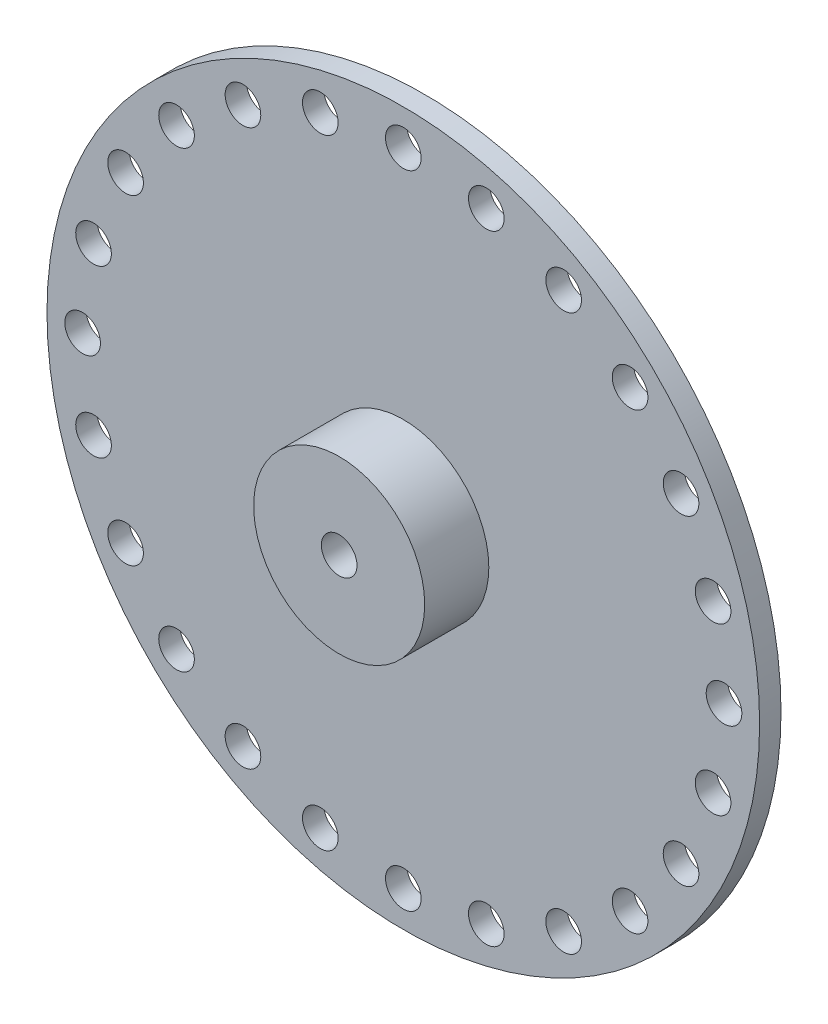
ISO-10303-21;
HEADER;
FILE_DESCRIPTION(('STEP AP214'),'2;1');
FILE_NAME('part.step','',(''),(''),'','','');
FILE_SCHEMA(('AUTOMOTIVE_DESIGN { 1 0 10303 214 1 1 1 1 }'));
ENDSEC;
DATA;
#1=APPLICATION_CONTEXT('core data for automotive mechanical design processes');
#2=APPLICATION_PROTOCOL_DEFINITION('international standard','automotive_design',2000,#1);
#3=PRODUCT_CONTEXT('',#1,'mechanical');
#4=PRODUCT('Part','Part','',(#3));
#5=PRODUCT_RELATED_PRODUCT_CATEGORY('part','',(#4));
#6=PRODUCT_DEFINITION_FORMATION('','',#4);
#7=PRODUCT_DEFINITION_CONTEXT('part definition',#1,'design');
#8=PRODUCT_DEFINITION('design','',#6,#7);
#9=PRODUCT_DEFINITION_SHAPE('','',#8);
#10=(LENGTH_UNIT() NAMED_UNIT(*) SI_UNIT(.MILLI.,.METRE.));
#11=(NAMED_UNIT(*) PLANE_ANGLE_UNIT() SI_UNIT($,.RADIAN.));
#12=(NAMED_UNIT(*) SI_UNIT($,.STERADIAN.) SOLID_ANGLE_UNIT());
#13=UNCERTAINTY_MEASURE_WITH_UNIT(LENGTH_MEASURE(1.E-05),#10,'distance_accuracy_value','');
#14=(GEOMETRIC_REPRESENTATION_CONTEXT(3) GLOBAL_UNCERTAINTY_ASSIGNED_CONTEXT((#13)) GLOBAL_UNIT_ASSIGNED_CONTEXT((#10,
#11,#12)) REPRESENTATION_CONTEXT('',''));
#15=CARTESIAN_POINT('',(0.,0.,0.));
#16=DIRECTION('',(0.,0.,1.));
#17=DIRECTION('',(1.,0.,0.));
#18=AXIS2_PLACEMENT_3D('',#15,#16,#17);
#19=CARTESIAN_POINT('',(0.,0.,1.5));
#20=DIRECTION('',(0.,0.,-1.));
#21=DIRECTION('',(-1.,0.,0.));
#22=AXIS2_PLACEMENT_3D('',#19,#20,#21);
#23=CYLINDRICAL_SURFACE('',#22,25.);
#24=CARTESIAN_POINT('',(0.,0.,1.5));
#25=DIRECTION('',(0.,0.,1.));
#26=DIRECTION('',(1.,0.,0.));
#27=AXIS2_PLACEMENT_3D('',#24,#25,#26);
#28=CIRCLE('',#27,25.);
#29=CARTESIAN_POINT('',(25.,0.,1.5));
#30=VERTEX_POINT('',#29);
#31=EDGE_CURVE('E52',#30,#30,#28,.T.);
#32=ORIENTED_EDGE('',*,*,#31,.F.);
#33=EDGE_LOOP('',(#32));
#34=FACE_BOUND('',#33,.T.);
#35=CARTESIAN_POINT('',(0.,0.,0.));
#36=DIRECTION('',(0.,0.,1.));
#37=DIRECTION('',(1.,0.,0.));
#38=AXIS2_PLACEMENT_3D('',#35,#36,#37);
#39=CIRCLE('',#38,25.);
#40=CARTESIAN_POINT('',(25.,0.,0.));
#41=VERTEX_POINT('',#40);
#42=EDGE_CURVE('E48',#41,#41,#39,.T.);
#43=ORIENTED_EDGE('',*,*,#42,.T.);
#44=EDGE_LOOP('',(#43));
#45=FACE_BOUND('',#44,.T.);
#46=ADVANCED_FACE('F45',(#34,#45),#23,.T.);
#47=CARTESIAN_POINT('',(0.,0.,1.5));
#48=DIRECTION('',(0.,0.,1.));
#49=DIRECTION('',(1.,0.,0.));
#50=AXIS2_PLACEMENT_3D('',#47,#48,#49);
#51=PLANE('',#50);
#52=CARTESIAN_POINT('',(-21.7333310915041,-5.8234285148065,1.5));
#53=DIRECTION('',(0.,0.,-1.));
#54=DIRECTION('',(0.258819045102511,-0.965925826289071,0.));
#55=AXIS2_PLACEMENT_3D('',#52,#53,#54);
#56=CIRCLE('',#55,1.25);
#57=CARTESIAN_POINT('',(-21.409807285126,-7.03083579766784,1.5));
#58=VERTEX_POINT('',#57);
#59=EDGE_CURVE('E131',#58,#58,#56,.T.);
#60=ORIENTED_EDGE('',*,*,#59,.T.);
#61=EDGE_LOOP('',(#60));
#62=FACE_BOUND('',#61,.T.);
#63=CARTESIAN_POINT('',(-19.48557158515,-11.2499999999998,1.5));
#64=DIRECTION('',(0.,0.,-1.));
#65=DIRECTION('',(0.499999999999992,-0.866025403784443,0.));
#66=AXIS2_PLACEMENT_3D('',#63,#64,#65);
#67=CIRCLE('',#66,1.25);
#68=CARTESIAN_POINT('',(-18.86057158515,-12.3325317547304,1.5));
#69=VERTEX_POINT('',#68);
#70=EDGE_CURVE('E138',#69,#69,#67,.T.);
#71=ORIENTED_EDGE('',*,*,#70,.T.);
#72=EDGE_LOOP('',(#71));
#73=FACE_BOUND('',#72,.T.);
#74=CARTESIAN_POINT('',(-15.9099025766975,-15.9099025766972,1.5));
#75=DIRECTION('',(0.,0.,-1.));
#76=DIRECTION('',(0.707106781186541,-0.707106781186554,0.));
#77=AXIS2_PLACEMENT_3D('',#74,#75,#76);
#78=CIRCLE('',#77,1.25);
#79=CARTESIAN_POINT('',(-15.0260191002143,-16.7937860531804,1.5));
#80=VERTEX_POINT('',#79);
#81=EDGE_CURVE('E144',#80,#80,#78,.T.);
#82=ORIENTED_EDGE('',*,*,#81,.T.);
#83=EDGE_LOOP('',(#82));
#84=FACE_BOUND('',#83,.T.);
#85=CARTESIAN_POINT('',(-11.2500000000002,-19.4855715851498,1.5));
#86=DIRECTION('',(0.,0.,-1.));
#87=DIRECTION('',(0.866025403784435,-0.500000000000007,0.));
#88=AXIS2_PLACEMENT_3D('',#85,#86,#87);
#89=CIRCLE('',#88,1.25);
#90=CARTESIAN_POINT('',(-10.1674682452696,-20.1105715851498,1.5));
#91=VERTEX_POINT('',#90);
#92=EDGE_CURVE('E150',#91,#91,#89,.T.);
#93=ORIENTED_EDGE('',*,*,#92,.T.);
#94=EDGE_LOOP('',(#93));
#95=FACE_BOUND('',#94,.T.);
#96=CARTESIAN_POINT('',(-5.82342851480688,-21.733331091504,1.5));
#97=DIRECTION('',(0.,0.,-1.));
#98=DIRECTION('',(0.965925826289066,-0.258819045102528,0.));
#99=AXIS2_PLACEMENT_3D('',#96,#97,#98);
#100=CIRCLE('',#99,1.25);
#101=CARTESIAN_POINT('',(-4.61602123194555,-22.0568548978822,1.5));
#102=VERTEX_POINT('',#101);
#103=EDGE_CURVE('E156',#102,#102,#100,.T.);
#104=ORIENTED_EDGE('',*,*,#103,.T.);
#105=EDGE_LOOP('',(#104));
#106=FACE_BOUND('',#105,.T.);
#107=CARTESIAN_POINT('',(0.,-22.5,1.5));
#108=DIRECTION('',(0.,0.,-1.));
#109=DIRECTION('',(1.,0.,0.));
#110=AXIS2_PLACEMENT_3D('',#107,#108,#109);
#111=CIRCLE('',#110,1.25);
#112=CARTESIAN_POINT('',(1.25,-22.5,1.5));
#113=VERTEX_POINT('',#112);
#114=EDGE_CURVE('E162',#113,#113,#111,.T.);
#115=ORIENTED_EDGE('',*,*,#114,.T.);
#116=EDGE_LOOP('',(#115));
#117=FACE_BOUND('',#116,.T.);
#118=CARTESIAN_POINT('',(5.82342851480658,-21.7333310915041,1.5));
#119=DIRECTION('',(0.,0.,-1.));
#120=DIRECTION('',(0.96592582628907,0.258819045102515,0.));
#121=AXIS2_PLACEMENT_3D('',#118,#119,#120);
#122=CIRCLE('',#121,1.25);
#123=CARTESIAN_POINT('',(7.03083579766792,-21.4098072851259,1.5));
#124=VERTEX_POINT('',#123);
#125=EDGE_CURVE('E168',#124,#124,#122,.T.);
#126=ORIENTED_EDGE('',*,*,#125,.T.);
#127=EDGE_LOOP('',(#126));
#128=FACE_BOUND('',#127,.T.);
#129=CARTESIAN_POINT('',(11.2499999999999,-19.4855715851499,1.5));
#130=DIRECTION('',(0.,0.,-1.));
#131=DIRECTION('',(0.866025403784442,0.499999999999995,0.));
#132=AXIS2_PLACEMENT_3D('',#129,#130,#131);
#133=CIRCLE('',#132,1.25);
#134=CARTESIAN_POINT('',(12.3325317547304,-18.8605715851499,1.5));
#135=VERTEX_POINT('',#134);
#136=EDGE_CURVE('E84',#135,#135,#133,.T.);
#137=ORIENTED_EDGE('',*,*,#136,.T.);
#138=EDGE_LOOP('',(#137));
#139=FACE_BOUND('',#138,.T.);
#140=CARTESIAN_POINT('',(15.9099025766972,-15.9099025766974,1.5));
#141=DIRECTION('',(0.,0.,-1.));
#142=DIRECTION('',(0.707106781186551,0.707106781186544,0.));
#143=AXIS2_PLACEMENT_3D('',#140,#141,#142);
#144=CIRCLE('',#143,1.25);
#145=CARTESIAN_POINT('',(16.7937860531804,-15.0260191002142,1.5));
#146=VERTEX_POINT('',#145);
#147=EDGE_CURVE('E83',#146,#146,#144,.T.);
#148=ORIENTED_EDGE('',*,*,#147,.T.);
#149=EDGE_LOOP('',(#148));
#150=FACE_BOUND('',#149,.T.);
#151=CARTESIAN_POINT('',(19.4855715851498,-11.2500000000001,1.5));
#152=DIRECTION('',(0.,0.,-1.));
#153=DIRECTION('',(0.500000000000004,0.866025403784436,0.));
#154=AXIS2_PLACEMENT_3D('',#151,#152,#153);
#155=CIRCLE('',#154,1.25);
#156=CARTESIAN_POINT('',(20.1105715851498,-10.1674682452695,1.5));
#157=VERTEX_POINT('',#156);
#158=EDGE_CURVE('E90',#157,#157,#155,.T.);
#159=ORIENTED_EDGE('',*,*,#158,.T.);
#160=EDGE_LOOP('',(#159));
#161=FACE_BOUND('',#160,.T.);
#162=CARTESIAN_POINT('',(21.733331091504,-5.82342851480681,1.5));
#163=DIRECTION('',(0.,0.,-1.));
#164=DIRECTION('',(0.258819045102525,0.965925826289067,0.));
#165=AXIS2_PLACEMENT_3D('',#162,#163,#164);
#166=CIRCLE('',#165,1.25);
#167=CARTESIAN_POINT('',(22.0568548978822,-4.61602123194547,1.5));
#168=VERTEX_POINT('',#167);
#169=EDGE_CURVE('E96',#168,#168,#166,.T.);
#170=ORIENTED_EDGE('',*,*,#169,.T.);
#171=EDGE_LOOP('',(#170));
#172=FACE_BOUND('',#171,.T.);
#173=CARTESIAN_POINT('',(22.5,0.,1.5));
#174=DIRECTION('',(0.,0.,-1.));
#175=DIRECTION('',(0.,1.,0.));
#176=AXIS2_PLACEMENT_3D('',#173,#174,#175);
#177=CIRCLE('',#176,1.25);
#178=CARTESIAN_POINT('',(22.5,1.24999999999992,1.5));
#179=VERTEX_POINT('',#178);
#180=EDGE_CURVE('E102',#179,#179,#177,.T.);
#181=ORIENTED_EDGE('',*,*,#180,.T.);
#182=EDGE_LOOP('',(#181));
#183=FACE_BOUND('',#182,.T.);
#184=CARTESIAN_POINT('',(21.7333310915041,5.82342851480665,1.5));
#185=DIRECTION('',(0.,0.,-1.));
#186=DIRECTION('',(-0.258819045102518,0.965925826289069,0.));
#187=AXIS2_PLACEMENT_3D('',#184,#185,#186);
#188=CIRCLE('',#187,1.25);
#189=CARTESIAN_POINT('',(21.4098072851259,7.03083579766799,1.5));
#190=VERTEX_POINT('',#189);
#191=EDGE_CURVE('E108',#190,#190,#188,.T.);
#192=ORIENTED_EDGE('',*,*,#191,.T.);
#193=EDGE_LOOP('',(#192));
#194=FACE_BOUND('',#193,.T.);
#195=CARTESIAN_POINT('',(19.4855715851499,11.25,1.5));
#196=DIRECTION('',(0.,0.,-1.));
#197=DIRECTION('',(-0.499999999999998,0.86602540378444,0.));
#198=AXIS2_PLACEMENT_3D('',#195,#196,#197);
#199=CIRCLE('',#198,1.25);
#200=CARTESIAN_POINT('',(18.8605715851499,12.3325317547305,1.5));
#201=VERTEX_POINT('',#200);
#202=EDGE_CURVE('E114',#201,#201,#199,.T.);
#203=ORIENTED_EDGE('',*,*,#202,.T.);
#204=EDGE_LOOP('',(#203));
#205=FACE_BOUND('',#204,.T.);
#206=CARTESIAN_POINT('',(15.9099025766973,15.9099025766973,1.5));
#207=DIRECTION('',(0.,0.,-1.));
#208=DIRECTION('',(-0.707106781186546,0.707106781186549,0.));
#209=AXIS2_PLACEMENT_3D('',#206,#207,#208);
#210=CIRCLE('',#209,1.25);
#211=CARTESIAN_POINT('',(15.0260191002142,16.7937860531805,1.5));
#212=VERTEX_POINT('',#211);
#213=EDGE_CURVE('E120',#212,#212,#210,.T.);
#214=ORIENTED_EDGE('',*,*,#213,.T.);
#215=EDGE_LOOP('',(#214));
#216=FACE_BOUND('',#215,.T.);
#217=CARTESIAN_POINT('',(11.25,19.4855715851499,1.5));
#218=DIRECTION('',(0.,0.,-1.));
#219=DIRECTION('',(-0.866025403784438,0.500000000000001,0.));
#220=AXIS2_PLACEMENT_3D('',#217,#218,#219);
#221=CIRCLE('',#220,1.25);
#222=CARTESIAN_POINT('',(10.1674682452695,20.1105715851499,1.5));
#223=VERTEX_POINT('',#222);
#224=EDGE_CURVE('E77',#223,#223,#221,.T.);
#225=ORIENTED_EDGE('',*,*,#224,.T.);
#226=EDGE_LOOP('',(#225));
#227=FACE_BOUND('',#226,.T.);
#228=CARTESIAN_POINT('',(-22.5,2.35674990371912E-13,1.5));
#229=DIRECTION('',(0.,0.,-1.));
#230=DIRECTION('',(0.,-1.,0.));
#231=AXIS2_PLACEMENT_3D('',#228,#229,#230);
#232=CIRCLE('',#231,1.25);
#233=CARTESIAN_POINT('',(-22.5,-1.24999999999977,1.5));
#234=VERTEX_POINT('',#233);
#235=EDGE_CURVE('E132',#234,#234,#232,.T.);
#236=ORIENTED_EDGE('',*,*,#235,.T.);
#237=EDGE_LOOP('',(#236));
#238=FACE_BOUND('',#237,.T.);
#239=CARTESIAN_POINT('',(-21.733331091504,5.82342851480696,1.5));
#240=DIRECTION('',(0.,0.,-1.));
#241=DIRECTION('',(-0.258819045102531,-0.965925826289065,0.));
#242=AXIS2_PLACEMENT_3D('',#239,#240,#241);
#243=CIRCLE('',#242,1.25);
#244=CARTESIAN_POINT('',(-22.0568548978821,4.61602123194562,1.5));
#245=VERTEX_POINT('',#244);
#246=EDGE_CURVE('E203',#245,#245,#243,.T.);
#247=ORIENTED_EDGE('',*,*,#246,.T.);
#248=EDGE_LOOP('',(#247));
#249=FACE_BOUND('',#248,.T.);
#250=CARTESIAN_POINT('',(-19.4855715851497,11.2500000000002,1.5));
#251=DIRECTION('',(0.,0.,-1.));
#252=DIRECTION('',(-0.50000000000001,-0.866025403784433,0.));
#253=AXIS2_PLACEMENT_3D('',#250,#251,#252);
#254=CIRCLE('',#253,1.25);
#255=CARTESIAN_POINT('',(-20.1105715851498,10.1674682452697,1.5));
#256=VERTEX_POINT('',#255);
#257=EDGE_CURVE('E197',#256,#256,#254,.T.);
#258=ORIENTED_EDGE('',*,*,#257,.T.);
#259=EDGE_LOOP('',(#258));
#260=FACE_BOUND('',#259,.T.);
#261=CARTESIAN_POINT('',(-15.9099025766971,15.9099025766975,1.5));
#262=DIRECTION('',(0.,0.,-1.));
#263=DIRECTION('',(-0.707106781186556,-0.707106781186539,0.));
#264=AXIS2_PLACEMENT_3D('',#261,#262,#263);
#265=CIRCLE('',#264,1.25);
#266=CARTESIAN_POINT('',(-16.7937860531803,15.0260191002143,1.5));
#267=VERTEX_POINT('',#266);
#268=EDGE_CURVE('E191',#267,#267,#265,.T.);
#269=ORIENTED_EDGE('',*,*,#268,.T.);
#270=EDGE_LOOP('',(#269));
#271=FACE_BOUND('',#270,.T.);
#272=CARTESIAN_POINT('',(-11.2499999999997,19.48557158515,1.5));
#273=DIRECTION('',(0.,0.,-1.));
#274=DIRECTION('',(-0.866025403784445,-0.499999999999989,0.));
#275=AXIS2_PLACEMENT_3D('',#272,#273,#274);
#276=CIRCLE('',#275,1.25);
#277=CARTESIAN_POINT('',(-12.3325317547303,18.86057158515,1.5));
#278=VERTEX_POINT('',#277);
#279=EDGE_CURVE('E185',#278,#278,#276,.T.);
#280=ORIENTED_EDGE('',*,*,#279,.T.);
#281=EDGE_LOOP('',(#280));
#282=FACE_BOUND('',#281,.T.);
#283=CARTESIAN_POINT('',(-5.82342851480643,21.7333310915041,1.5));
#284=DIRECTION('',(0.,0.,-1.));
#285=DIRECTION('',(-0.965925826289072,-0.258819045102508,0.));
#286=AXIS2_PLACEMENT_3D('',#283,#284,#285);
#287=CIRCLE('',#286,1.25);
#288=CARTESIAN_POINT('',(-7.03083579766777,21.409807285126,1.5));
#289=VERTEX_POINT('',#288);
#290=EDGE_CURVE('E179',#289,#289,#287,.T.);
#291=ORIENTED_EDGE('',*,*,#290,.T.);
#292=EDGE_LOOP('',(#291));
#293=FACE_BOUND('',#292,.T.);
#294=CARTESIAN_POINT('',(5.82342851480673,21.733331091504,1.5));
#295=DIRECTION('',(0.,0.,-1.));
#296=DIRECTION('',(-0.965925826289068,0.258819045102521,0.));
#297=AXIS2_PLACEMENT_3D('',#294,#295,#296);
#298=CIRCLE('',#297,1.25);
#299=CARTESIAN_POINT('',(4.61602123194539,22.0568548978822,1.5));
#300=VERTEX_POINT('',#299);
#301=EDGE_CURVE('E71',#300,#300,#298,.T.);
#302=ORIENTED_EDGE('',*,*,#301,.T.);
#303=EDGE_LOOP('',(#302));
#304=FACE_BOUND('',#303,.T.);
#305=CARTESIAN_POINT('',(0.,22.5,1.5));
#306=DIRECTION('',(0.,0.,-1.));
#307=DIRECTION('',(-1.,0.,0.));
#308=AXIS2_PLACEMENT_3D('',#305,#306,#307);
#309=CIRCLE('',#308,1.25);
#310=CARTESIAN_POINT('',(-1.25,22.5,1.5));
#311=VERTEX_POINT('',#310);
#312=EDGE_CURVE('E65',#311,#311,#309,.T.);
#313=ORIENTED_EDGE('',*,*,#312,.T.);
#314=EDGE_LOOP('',(#313));
#315=FACE_BOUND('',#314,.T.);
#316=CARTESIAN_POINT('',(0.,0.,1.5));
#317=DIRECTION('',(0.,0.,1.));
#318=DIRECTION('',(1.,0.,0.));
#319=AXIS2_PLACEMENT_3D('',#316,#317,#318);
#320=CIRCLE('',#319,6.);
#321=CARTESIAN_POINT('',(6.,0.,1.5));
#322=VERTEX_POINT('',#321);
#323=EDGE_CURVE('E12',#322,#322,#320,.T.);
#324=ORIENTED_EDGE('',*,*,#323,.F.);
#325=EDGE_LOOP('',(#324));
#326=FACE_BOUND('',#325,.T.);
#327=ORIENTED_EDGE('',*,*,#31,.T.);
#328=EDGE_LOOP('',(#327));
#329=FACE_BOUND('',#328,.T.);
#330=ADVANCED_FACE('F212',(#62,#73,#84,#95,#106,#117,#128,#139,#150,#161,#172,#183,#194,#205,
#216,#227,#238,#249,#260,#271,#282,#293,#304,#315,#326,#329),#51,.T.);
#331=CARTESIAN_POINT('',(0.,0.,0.));
#332=DIRECTION('',(0.,0.,1.));
#333=DIRECTION('',(1.,0.,0.));
#334=AXIS2_PLACEMENT_3D('',#331,#332,#333);
#335=PLANE('',#334);
#336=CARTESIAN_POINT('',(-21.7333310915041,-5.8234285148065,0.));
#337=DIRECTION('',(0.,0.,-1.));
#338=DIRECTION('',(0.258819045102511,-0.965925826289071,0.));
#339=AXIS2_PLACEMENT_3D('',#336,#337,#338);
#340=CIRCLE('',#339,1.25);
#341=CARTESIAN_POINT('',(-21.409807285126,-7.03083579766784,0.));
#342=VERTEX_POINT('',#341);
#343=EDGE_CURVE('E128',#342,#342,#340,.T.);
#344=ORIENTED_EDGE('',*,*,#343,.F.);
#345=EDGE_LOOP('',(#344));
#346=FACE_BOUND('',#345,.T.);
#347=CARTESIAN_POINT('',(-19.48557158515,-11.2499999999998,0.));
#348=DIRECTION('',(0.,0.,-1.));
#349=DIRECTION('',(0.499999999999992,-0.866025403784443,0.));
#350=AXIS2_PLACEMENT_3D('',#347,#348,#349);
#351=CIRCLE('',#350,1.25);
#352=CARTESIAN_POINT('',(-18.86057158515,-12.3325317547304,0.));
#353=VERTEX_POINT('',#352);
#354=EDGE_CURVE('E135',#353,#353,#351,.T.);
#355=ORIENTED_EDGE('',*,*,#354,.F.);
#356=EDGE_LOOP('',(#355));
#357=FACE_BOUND('',#356,.T.);
#358=CARTESIAN_POINT('',(-15.9099025766975,-15.9099025766972,0.));
#359=DIRECTION('',(0.,0.,-1.));
#360=DIRECTION('',(0.707106781186541,-0.707106781186554,0.));
#361=AXIS2_PLACEMENT_3D('',#358,#359,#360);
#362=CIRCLE('',#361,1.25);
#363=CARTESIAN_POINT('',(-15.0260191002143,-16.7937860531804,0.));
#364=VERTEX_POINT('',#363);
#365=EDGE_CURVE('E141',#364,#364,#362,.T.);
#366=ORIENTED_EDGE('',*,*,#365,.F.);
#367=EDGE_LOOP('',(#366));
#368=FACE_BOUND('',#367,.T.);
#369=CARTESIAN_POINT('',(-11.2500000000002,-19.4855715851498,0.));
#370=DIRECTION('',(0.,0.,-1.));
#371=DIRECTION('',(0.866025403784435,-0.500000000000007,0.));
#372=AXIS2_PLACEMENT_3D('',#369,#370,#371);
#373=CIRCLE('',#372,1.25);
#374=CARTESIAN_POINT('',(-10.1674682452696,-20.1105715851498,0.));
#375=VERTEX_POINT('',#374);
#376=EDGE_CURVE('E147',#375,#375,#373,.T.);
#377=ORIENTED_EDGE('',*,*,#376,.F.);
#378=EDGE_LOOP('',(#377));
#379=FACE_BOUND('',#378,.T.);
#380=CARTESIAN_POINT('',(-5.82342851480688,-21.733331091504,0.));
#381=DIRECTION('',(0.,0.,-1.));
#382=DIRECTION('',(0.965925826289066,-0.258819045102528,0.));
#383=AXIS2_PLACEMENT_3D('',#380,#381,#382);
#384=CIRCLE('',#383,1.25);
#385=CARTESIAN_POINT('',(-4.61602123194555,-22.0568548978822,0.));
#386=VERTEX_POINT('',#385);
#387=EDGE_CURVE('E153',#386,#386,#384,.T.);
#388=ORIENTED_EDGE('',*,*,#387,.F.);
#389=EDGE_LOOP('',(#388));
#390=FACE_BOUND('',#389,.T.);
#391=CARTESIAN_POINT('',(0.,-22.5,0.));
#392=DIRECTION('',(0.,0.,-1.));
#393=DIRECTION('',(1.,0.,0.));
#394=AXIS2_PLACEMENT_3D('',#391,#392,#393);
#395=CIRCLE('',#394,1.25);
#396=CARTESIAN_POINT('',(1.25,-22.5,0.));
#397=VERTEX_POINT('',#396);
#398=EDGE_CURVE('E159',#397,#397,#395,.T.);
#399=ORIENTED_EDGE('',*,*,#398,.F.);
#400=EDGE_LOOP('',(#399));
#401=FACE_BOUND('',#400,.T.);
#402=CARTESIAN_POINT('',(5.82342851480658,-21.7333310915041,0.));
#403=DIRECTION('',(0.,0.,-1.));
#404=DIRECTION('',(0.96592582628907,0.258819045102515,0.));
#405=AXIS2_PLACEMENT_3D('',#402,#403,#404);
#406=CIRCLE('',#405,1.25);
#407=CARTESIAN_POINT('',(7.03083579766792,-21.4098072851259,0.));
#408=VERTEX_POINT('',#407);
#409=EDGE_CURVE('E165',#408,#408,#406,.T.);
#410=ORIENTED_EDGE('',*,*,#409,.F.);
#411=EDGE_LOOP('',(#410));
#412=FACE_BOUND('',#411,.T.);
#413=CARTESIAN_POINT('',(11.2499999999999,-19.4855715851499,0.));
#414=DIRECTION('',(0.,0.,-1.));
#415=DIRECTION('',(0.866025403784442,0.499999999999995,0.));
#416=AXIS2_PLACEMENT_3D('',#413,#414,#415);
#417=CIRCLE('',#416,1.25);
#418=CARTESIAN_POINT('',(12.3325317547304,-18.8605715851499,0.));
#419=VERTEX_POINT('',#418);
#420=EDGE_CURVE('E171',#419,#419,#417,.T.);
#421=ORIENTED_EDGE('',*,*,#420,.F.);
#422=EDGE_LOOP('',(#421));
#423=FACE_BOUND('',#422,.T.);
#424=CARTESIAN_POINT('',(15.9099025766972,-15.9099025766974,0.));
#425=DIRECTION('',(0.,0.,-1.));
#426=DIRECTION('',(0.707106781186551,0.707106781186544,0.));
#427=AXIS2_PLACEMENT_3D('',#424,#425,#426);
#428=CIRCLE('',#427,1.25);
#429=CARTESIAN_POINT('',(16.7937860531804,-15.0260191002142,0.));
#430=VERTEX_POINT('',#429);
#431=EDGE_CURVE('E80',#430,#430,#428,.T.);
#432=ORIENTED_EDGE('',*,*,#431,.F.);
#433=EDGE_LOOP('',(#432));
#434=FACE_BOUND('',#433,.T.);
#435=CARTESIAN_POINT('',(19.4855715851498,-11.2500000000001,0.));
#436=DIRECTION('',(0.,0.,-1.));
#437=DIRECTION('',(0.500000000000004,0.866025403784436,0.));
#438=AXIS2_PLACEMENT_3D('',#435,#436,#437);
#439=CIRCLE('',#438,1.25);
#440=CARTESIAN_POINT('',(20.1105715851498,-10.1674682452695,0.));
#441=VERTEX_POINT('',#440);
#442=EDGE_CURVE('E87',#441,#441,#439,.T.);
#443=ORIENTED_EDGE('',*,*,#442,.F.);
#444=EDGE_LOOP('',(#443));
#445=FACE_BOUND('',#444,.T.);
#446=CARTESIAN_POINT('',(21.733331091504,-5.82342851480681,0.));
#447=DIRECTION('',(0.,0.,-1.));
#448=DIRECTION('',(0.258819045102525,0.965925826289067,0.));
#449=AXIS2_PLACEMENT_3D('',#446,#447,#448);
#450=CIRCLE('',#449,1.25);
#451=CARTESIAN_POINT('',(22.0568548978822,-4.61602123194547,0.));
#452=VERTEX_POINT('',#451);
#453=EDGE_CURVE('E93',#452,#452,#450,.T.);
#454=ORIENTED_EDGE('',*,*,#453,.F.);
#455=EDGE_LOOP('',(#454));
#456=FACE_BOUND('',#455,.T.);
#457=CARTESIAN_POINT('',(22.5,0.,0.));
#458=DIRECTION('',(0.,0.,-1.));
#459=DIRECTION('',(0.,1.,0.));
#460=AXIS2_PLACEMENT_3D('',#457,#458,#459);
#461=CIRCLE('',#460,1.25);
#462=CARTESIAN_POINT('',(22.5,1.24999999999992,0.));
#463=VERTEX_POINT('',#462);
#464=EDGE_CURVE('E99',#463,#463,#461,.T.);
#465=ORIENTED_EDGE('',*,*,#464,.F.);
#466=EDGE_LOOP('',(#465));
#467=FACE_BOUND('',#466,.T.);
#468=CARTESIAN_POINT('',(21.7333310915041,5.82342851480665,0.));
#469=DIRECTION('',(0.,0.,-1.));
#470=DIRECTION('',(-0.258819045102518,0.965925826289069,0.));
#471=AXIS2_PLACEMENT_3D('',#468,#469,#470);
#472=CIRCLE('',#471,1.25);
#473=CARTESIAN_POINT('',(21.4098072851259,7.03083579766799,0.));
#474=VERTEX_POINT('',#473);
#475=EDGE_CURVE('E105',#474,#474,#472,.T.);
#476=ORIENTED_EDGE('',*,*,#475,.F.);
#477=EDGE_LOOP('',(#476));
#478=FACE_BOUND('',#477,.T.);
#479=CARTESIAN_POINT('',(19.4855715851499,11.25,0.));
#480=DIRECTION('',(0.,0.,-1.));
#481=DIRECTION('',(-0.499999999999998,0.86602540378444,0.));
#482=AXIS2_PLACEMENT_3D('',#479,#480,#481);
#483=CIRCLE('',#482,1.25);
#484=CARTESIAN_POINT('',(18.8605715851499,12.3325317547305,0.));
#485=VERTEX_POINT('',#484);
#486=EDGE_CURVE('E111',#485,#485,#483,.T.);
#487=ORIENTED_EDGE('',*,*,#486,.F.);
#488=EDGE_LOOP('',(#487));
#489=FACE_BOUND('',#488,.T.);
#490=CARTESIAN_POINT('',(15.9099025766973,15.9099025766973,0.));
#491=DIRECTION('',(0.,0.,-1.));
#492=DIRECTION('',(-0.707106781186546,0.707106781186549,0.));
#493=AXIS2_PLACEMENT_3D('',#490,#491,#492);
#494=CIRCLE('',#493,1.25);
#495=CARTESIAN_POINT('',(15.0260191002142,16.7937860531805,0.));
#496=VERTEX_POINT('',#495);
#497=EDGE_CURVE('E117',#496,#496,#494,.T.);
#498=ORIENTED_EDGE('',*,*,#497,.F.);
#499=EDGE_LOOP('',(#498));
#500=FACE_BOUND('',#499,.T.);
#501=CARTESIAN_POINT('',(11.25,19.4855715851499,0.));
#502=DIRECTION('',(0.,0.,-1.));
#503=DIRECTION('',(-0.866025403784438,0.500000000000001,0.));
#504=AXIS2_PLACEMENT_3D('',#501,#502,#503);
#505=CIRCLE('',#504,1.25);
#506=CARTESIAN_POINT('',(10.1674682452695,20.1105715851499,0.));
#507=VERTEX_POINT('',#506);
#508=EDGE_CURVE('E123',#507,#507,#505,.T.);
#509=ORIENTED_EDGE('',*,*,#508,.F.);
#510=EDGE_LOOP('',(#509));
#511=FACE_BOUND('',#510,.T.);
#512=CARTESIAN_POINT('',(-22.5,2.35674990371912E-13,0.));
#513=DIRECTION('',(0.,0.,-1.));
#514=DIRECTION('',(0.,-1.,0.));
#515=AXIS2_PLACEMENT_3D('',#512,#513,#514);
#516=CIRCLE('',#515,1.25);
#517=CARTESIAN_POINT('',(-22.5,-1.24999999999977,0.));
#518=VERTEX_POINT('',#517);
#519=EDGE_CURVE('E206',#518,#518,#516,.T.);
#520=ORIENTED_EDGE('',*,*,#519,.F.);
#521=EDGE_LOOP('',(#520));
#522=FACE_BOUND('',#521,.T.);
#523=CARTESIAN_POINT('',(-21.733331091504,5.82342851480696,0.));
#524=DIRECTION('',(0.,0.,-1.));
#525=DIRECTION('',(-0.258819045102531,-0.965925826289065,0.));
#526=AXIS2_PLACEMENT_3D('',#523,#524,#525);
#527=CIRCLE('',#526,1.25);
#528=CARTESIAN_POINT('',(-22.0568548978821,4.61602123194562,0.));
#529=VERTEX_POINT('',#528);
#530=EDGE_CURVE('E200',#529,#529,#527,.T.);
#531=ORIENTED_EDGE('',*,*,#530,.F.);
#532=EDGE_LOOP('',(#531));
#533=FACE_BOUND('',#532,.T.);
#534=CARTESIAN_POINT('',(-19.4855715851497,11.2500000000002,0.));
#535=DIRECTION('',(0.,0.,-1.));
#536=DIRECTION('',(-0.50000000000001,-0.866025403784433,0.));
#537=AXIS2_PLACEMENT_3D('',#534,#535,#536);
#538=CIRCLE('',#537,1.25);
#539=CARTESIAN_POINT('',(-20.1105715851498,10.1674682452697,0.));
#540=VERTEX_POINT('',#539);
#541=EDGE_CURVE('E194',#540,#540,#538,.T.);
#542=ORIENTED_EDGE('',*,*,#541,.F.);
#543=EDGE_LOOP('',(#542));
#544=FACE_BOUND('',#543,.T.);
#545=CARTESIAN_POINT('',(-15.9099025766971,15.9099025766975,0.));
#546=DIRECTION('',(0.,0.,-1.));
#547=DIRECTION('',(-0.707106781186556,-0.707106781186539,0.));
#548=AXIS2_PLACEMENT_3D('',#545,#546,#547);
#549=CIRCLE('',#548,1.25);
#550=CARTESIAN_POINT('',(-16.7937860531803,15.0260191002143,0.));
#551=VERTEX_POINT('',#550);
#552=EDGE_CURVE('E188',#551,#551,#549,.T.);
#553=ORIENTED_EDGE('',*,*,#552,.F.);
#554=EDGE_LOOP('',(#553));
#555=FACE_BOUND('',#554,.T.);
#556=CARTESIAN_POINT('',(-11.2499999999997,19.48557158515,0.));
#557=DIRECTION('',(0.,0.,-1.));
#558=DIRECTION('',(-0.866025403784445,-0.499999999999989,0.));
#559=AXIS2_PLACEMENT_3D('',#556,#557,#558);
#560=CIRCLE('',#559,1.25);
#561=CARTESIAN_POINT('',(-12.3325317547303,18.86057158515,0.));
#562=VERTEX_POINT('',#561);
#563=EDGE_CURVE('E182',#562,#562,#560,.T.);
#564=ORIENTED_EDGE('',*,*,#563,.F.);
#565=EDGE_LOOP('',(#564));
#566=FACE_BOUND('',#565,.T.);
#567=CARTESIAN_POINT('',(-5.82342851480643,21.7333310915041,0.));
#568=DIRECTION('',(0.,0.,-1.));
#569=DIRECTION('',(-0.965925826289072,-0.258819045102508,0.));
#570=AXIS2_PLACEMENT_3D('',#567,#568,#569);
#571=CIRCLE('',#570,1.25);
#572=CARTESIAN_POINT('',(-7.03083579766777,21.409807285126,0.));
#573=VERTEX_POINT('',#572);
#574=EDGE_CURVE('E176',#573,#573,#571,.T.);
#575=ORIENTED_EDGE('',*,*,#574,.F.);
#576=EDGE_LOOP('',(#575));
#577=FACE_BOUND('',#576,.T.);
#578=CARTESIAN_POINT('',(5.82342851480673,21.733331091504,0.));
#579=DIRECTION('',(0.,0.,-1.));
#580=DIRECTION('',(-0.965925826289068,0.258819045102521,0.));
#581=AXIS2_PLACEMENT_3D('',#578,#579,#580);
#582=CIRCLE('',#581,1.25);
#583=CARTESIAN_POINT('',(4.61602123194539,22.0568548978822,0.));
#584=VERTEX_POINT('',#583);
#585=EDGE_CURVE('E74',#584,#584,#582,.T.);
#586=ORIENTED_EDGE('',*,*,#585,.F.);
#587=EDGE_LOOP('',(#586));
#588=FACE_BOUND('',#587,.T.);
#589=CARTESIAN_POINT('',(0.,22.5,0.));
#590=DIRECTION('',(0.,0.,-1.));
#591=DIRECTION('',(-1.,0.,0.));
#592=AXIS2_PLACEMENT_3D('',#589,#590,#591);
#593=CIRCLE('',#592,1.25);
#594=CARTESIAN_POINT('',(-1.25,22.5,0.));
#595=VERTEX_POINT('',#594);
#596=EDGE_CURVE('E68',#595,#595,#593,.T.);
#597=ORIENTED_EDGE('',*,*,#596,.F.);
#598=EDGE_LOOP('',(#597));
#599=FACE_BOUND('',#598,.T.);
#600=CARTESIAN_POINT('',(0.,0.,0.));
#601=DIRECTION('',(0.,0.,1.));
#602=DIRECTION('',(1.,0.,0.));
#603=AXIS2_PLACEMENT_3D('',#600,#601,#602);
#604=CIRCLE('',#603,1.25);
#605=CARTESIAN_POINT('',(1.25,0.,0.));
#606=VERTEX_POINT('',#605);
#607=EDGE_CURVE('E61',#606,#606,#604,.T.);
#608=ORIENTED_EDGE('',*,*,#607,.T.);
#609=EDGE_LOOP('',(#608));
#610=FACE_BOUND('',#609,.T.);
#611=ORIENTED_EDGE('',*,*,#42,.F.);
#612=EDGE_LOOP('',(#611));
#613=FACE_BOUND('',#612,.T.);
#614=ADVANCED_FACE('F223',(#346,#357,#368,#379,#390,#401,#412,#423,#434,#445,#456,#467,#478,
#489,#500,#511,#522,#533,#544,#555,#566,#577,#588,#599,#610,#613),#335,.F.);
#615=CARTESIAN_POINT('',(0.,0.,6.));
#616=DIRECTION('',(0.,0.,-1.));
#617=DIRECTION('',(-1.,0.,0.));
#618=AXIS2_PLACEMENT_3D('',#615,#616,#617);
#619=CYLINDRICAL_SURFACE('',#618,6.);
#620=CARTESIAN_POINT('',(0.,0.,6.));
#621=DIRECTION('',(0.,0.,1.));
#622=DIRECTION('',(1.,0.,0.));
#623=AXIS2_PLACEMENT_3D('',#620,#621,#622);
#624=CIRCLE('',#623,6.);
#625=CARTESIAN_POINT('',(6.,0.,6.));
#626=VERTEX_POINT('',#625);
#627=EDGE_CURVE('E58',#626,#626,#624,.T.);
#628=ORIENTED_EDGE('',*,*,#627,.F.);
#629=EDGE_LOOP('',(#628));
#630=FACE_BOUND('',#629,.T.);
#631=ORIENTED_EDGE('',*,*,#323,.T.);
#632=EDGE_LOOP('',(#631));
#633=FACE_BOUND('',#632,.T.);
#634=ADVANCED_FACE('F226',(#630,#633),#619,.T.);
#635=CARTESIAN_POINT('',(0.,0.,6.));
#636=DIRECTION('',(0.,0.,1.));
#637=DIRECTION('',(1.,0.,0.));
#638=AXIS2_PLACEMENT_3D('',#635,#636,#637);
#639=PLANE('',#638);
#640=CARTESIAN_POINT('',(0.,0.,6.));
#641=DIRECTION('',(0.,0.,1.));
#642=DIRECTION('',(1.,0.,0.));
#643=AXIS2_PLACEMENT_3D('',#640,#641,#642);
#644=CIRCLE('',#643,1.25);
#645=CARTESIAN_POINT('',(1.25,0.,6.));
#646=VERTEX_POINT('',#645);
#647=EDGE_CURVE('E62',#646,#646,#644,.T.);
#648=ORIENTED_EDGE('',*,*,#647,.F.);
#649=EDGE_LOOP('',(#648));
#650=FACE_BOUND('',#649,.T.);
#651=ORIENTED_EDGE('',*,*,#627,.T.);
#652=EDGE_LOOP('',(#651));
#653=FACE_BOUND('',#652,.T.);
#654=ADVANCED_FACE('F262',(#650,#653),#639,.T.);
#655=CARTESIAN_POINT('',(0.,0.,0.));
#656=DIRECTION('',(0.,0.,1.));
#657=DIRECTION('',(1.,0.,0.));
#658=AXIS2_PLACEMENT_3D('',#655,#656,#657);
#659=CYLINDRICAL_SURFACE('',#658,1.25);
#660=ORIENTED_EDGE('',*,*,#607,.F.);
#661=EDGE_LOOP('',(#660));
#662=FACE_BOUND('',#661,.T.);
#663=ORIENTED_EDGE('',*,*,#647,.T.);
#664=EDGE_LOOP('',(#663));
#665=FACE_BOUND('',#664,.T.);
#666=ADVANCED_FACE('F266',(#662,#665),#659,.F.);
#667=CARTESIAN_POINT('',(0.,22.5,1.5));
#668=DIRECTION('',(0.,0.,-1.));
#669=DIRECTION('',(-1.,0.,0.));
#670=AXIS2_PLACEMENT_3D('',#667,#668,#669);
#671=CYLINDRICAL_SURFACE('',#670,1.25);
#672=ORIENTED_EDGE('',*,*,#312,.F.);
#673=EDGE_LOOP('',(#672));
#674=FACE_BOUND('',#673,.T.);
#675=ORIENTED_EDGE('',*,*,#596,.T.);
#676=EDGE_LOOP('',(#675));
#677=FACE_BOUND('',#676,.T.);
#678=ADVANCED_FACE('F270',(#674,#677),#671,.F.);
#679=CARTESIAN_POINT('',(5.82342851480673,21.733331091504,1.5));
#680=DIRECTION('',(0.,0.,-1.));
#681=DIRECTION('',(-1.,0.,0.));
#682=AXIS2_PLACEMENT_3D('',#679,#680,#681);
#683=CYLINDRICAL_SURFACE('',#682,1.25);
#684=ORIENTED_EDGE('',*,*,#301,.F.);
#685=EDGE_LOOP('',(#684));
#686=FACE_BOUND('',#685,.T.);
#687=ORIENTED_EDGE('',*,*,#585,.T.);
#688=EDGE_LOOP('',(#687));
#689=FACE_BOUND('',#688,.T.);
#690=ADVANCED_FACE('F274',(#686,#689),#683,.F.);
#691=CARTESIAN_POINT('',(-5.82342851480643,21.7333310915041,1.5));
#692=DIRECTION('',(0.,0.,-1.));
#693=DIRECTION('',(-1.,0.,0.));
#694=AXIS2_PLACEMENT_3D('',#691,#692,#693);
#695=CYLINDRICAL_SURFACE('',#694,1.25);
#696=ORIENTED_EDGE('',*,*,#290,.F.);
#697=EDGE_LOOP('',(#696));
#698=FACE_BOUND('',#697,.T.);
#699=ORIENTED_EDGE('',*,*,#574,.T.);
#700=EDGE_LOOP('',(#699));
#701=FACE_BOUND('',#700,.T.);
#702=ADVANCED_FACE('F278',(#698,#701),#695,.F.);
#703=CARTESIAN_POINT('',(-11.2499999999997,19.48557158515,1.5));
#704=DIRECTION('',(0.,0.,-1.));
#705=DIRECTION('',(-1.,0.,0.));
#706=AXIS2_PLACEMENT_3D('',#703,#704,#705);
#707=CYLINDRICAL_SURFACE('',#706,1.25);
#708=ORIENTED_EDGE('',*,*,#279,.F.);
#709=EDGE_LOOP('',(#708));
#710=FACE_BOUND('',#709,.T.);
#711=ORIENTED_EDGE('',*,*,#563,.T.);
#712=EDGE_LOOP('',(#711));
#713=FACE_BOUND('',#712,.T.);
#714=ADVANCED_FACE('F345',(#710,#713),#707,.F.);
#715=CARTESIAN_POINT('',(-15.9099025766971,15.9099025766975,1.5));
#716=DIRECTION('',(0.,0.,-1.));
#717=DIRECTION('',(-1.,0.,0.));
#718=AXIS2_PLACEMENT_3D('',#715,#716,#717);
#719=CYLINDRICAL_SURFACE('',#718,1.25);
#720=ORIENTED_EDGE('',*,*,#268,.F.);
#721=EDGE_LOOP('',(#720));
#722=FACE_BOUND('',#721,.T.);
#723=ORIENTED_EDGE('',*,*,#552,.T.);
#724=EDGE_LOOP('',(#723));
#725=FACE_BOUND('',#724,.T.);
#726=ADVANCED_FACE('F349',(#722,#725),#719,.F.);
#727=CARTESIAN_POINT('',(-19.4855715851497,11.2500000000002,1.5));
#728=DIRECTION('',(0.,0.,-1.));
#729=DIRECTION('',(-1.,0.,0.));
#730=AXIS2_PLACEMENT_3D('',#727,#728,#729);
#731=CYLINDRICAL_SURFACE('',#730,1.25);
#732=ORIENTED_EDGE('',*,*,#257,.F.);
#733=EDGE_LOOP('',(#732));
#734=FACE_BOUND('',#733,.T.);
#735=ORIENTED_EDGE('',*,*,#541,.T.);
#736=EDGE_LOOP('',(#735));
#737=FACE_BOUND('',#736,.T.);
#738=ADVANCED_FACE('F353',(#734,#737),#731,.F.);
#739=CARTESIAN_POINT('',(-21.733331091504,5.82342851480696,1.5));
#740=DIRECTION('',(0.,0.,-1.));
#741=DIRECTION('',(-1.,0.,0.));
#742=AXIS2_PLACEMENT_3D('',#739,#740,#741);
#743=CYLINDRICAL_SURFACE('',#742,1.25);
#744=ORIENTED_EDGE('',*,*,#246,.F.);
#745=EDGE_LOOP('',(#744));
#746=FACE_BOUND('',#745,.T.);
#747=ORIENTED_EDGE('',*,*,#530,.T.);
#748=EDGE_LOOP('',(#747));
#749=FACE_BOUND('',#748,.T.);
#750=ADVANCED_FACE('F219',(#746,#749),#743,.F.);
#751=CARTESIAN_POINT('',(-22.5,2.35674990371912E-13,1.5));
#752=DIRECTION('',(0.,0.,-1.));
#753=DIRECTION('',(-1.,0.,0.));
#754=AXIS2_PLACEMENT_3D('',#751,#752,#753);
#755=CYLINDRICAL_SURFACE('',#754,1.25);
#756=ORIENTED_EDGE('',*,*,#235,.F.);
#757=EDGE_LOOP('',(#756));
#758=FACE_BOUND('',#757,.T.);
#759=ORIENTED_EDGE('',*,*,#519,.T.);
#760=EDGE_LOOP('',(#759));
#761=FACE_BOUND('',#760,.T.);
#762=ADVANCED_FACE('F215',(#758,#761),#755,.F.);
#763=CARTESIAN_POINT('',(11.25,19.4855715851499,1.5));
#764=DIRECTION('',(0.,0.,-1.));
#765=DIRECTION('',(-1.,0.,0.));
#766=AXIS2_PLACEMENT_3D('',#763,#764,#765);
#767=CYLINDRICAL_SURFACE('',#766,1.25);
#768=ORIENTED_EDGE('',*,*,#224,.F.);
#769=EDGE_LOOP('',(#768));
#770=FACE_BOUND('',#769,.T.);
#771=ORIENTED_EDGE('',*,*,#508,.T.);
#772=EDGE_LOOP('',(#771));
#773=FACE_BOUND('',#772,.T.);
#774=ADVANCED_FACE('F218',(#770,#773),#767,.F.);
#775=CARTESIAN_POINT('',(15.9099025766973,15.9099025766973,1.5));
#776=DIRECTION('',(0.,0.,-1.));
#777=DIRECTION('',(-1.,0.,0.));
#778=AXIS2_PLACEMENT_3D('',#775,#776,#777);
#779=CYLINDRICAL_SURFACE('',#778,1.25);
#780=ORIENTED_EDGE('',*,*,#213,.F.);
#781=EDGE_LOOP('',(#780));
#782=FACE_BOUND('',#781,.T.);
#783=ORIENTED_EDGE('',*,*,#497,.T.);
#784=EDGE_LOOP('',(#783));
#785=FACE_BOUND('',#784,.T.);
#786=ADVANCED_FACE('F304',(#782,#785),#779,.F.);
#787=CARTESIAN_POINT('',(19.4855715851499,11.25,1.5));
#788=DIRECTION('',(0.,0.,-1.));
#789=DIRECTION('',(-1.,0.,0.));
#790=AXIS2_PLACEMENT_3D('',#787,#788,#789);
#791=CYLINDRICAL_SURFACE('',#790,1.25);
#792=ORIENTED_EDGE('',*,*,#202,.F.);
#793=EDGE_LOOP('',(#792));
#794=FACE_BOUND('',#793,.T.);
#795=ORIENTED_EDGE('',*,*,#486,.T.);
#796=EDGE_LOOP('',(#795));
#797=FACE_BOUND('',#796,.T.);
#798=ADVANCED_FACE('F300',(#794,#797),#791,.F.);
#799=CARTESIAN_POINT('',(21.7333310915041,5.82342851480665,1.5));
#800=DIRECTION('',(0.,0.,-1.));
#801=DIRECTION('',(-1.,0.,0.));
#802=AXIS2_PLACEMENT_3D('',#799,#800,#801);
#803=CYLINDRICAL_SURFACE('',#802,1.25);
#804=ORIENTED_EDGE('',*,*,#191,.F.);
#805=EDGE_LOOP('',(#804));
#806=FACE_BOUND('',#805,.T.);
#807=ORIENTED_EDGE('',*,*,#475,.T.);
#808=EDGE_LOOP('',(#807));
#809=FACE_BOUND('',#808,.T.);
#810=ADVANCED_FACE('F296',(#806,#809),#803,.F.);
#811=CARTESIAN_POINT('',(22.5,0.,1.5));
#812=DIRECTION('',(0.,0.,-1.));
#813=DIRECTION('',(-1.,0.,0.));
#814=AXIS2_PLACEMENT_3D('',#811,#812,#813);
#815=CYLINDRICAL_SURFACE('',#814,1.25);
#816=ORIENTED_EDGE('',*,*,#180,.F.);
#817=EDGE_LOOP('',(#816));
#818=FACE_BOUND('',#817,.T.);
#819=ORIENTED_EDGE('',*,*,#464,.T.);
#820=EDGE_LOOP('',(#819));
#821=FACE_BOUND('',#820,.T.);
#822=ADVANCED_FACE('F292',(#818,#821),#815,.F.);
#823=CARTESIAN_POINT('',(21.733331091504,-5.82342851480681,1.5));
#824=DIRECTION('',(0.,0.,-1.));
#825=DIRECTION('',(-1.,0.,0.));
#826=AXIS2_PLACEMENT_3D('',#823,#824,#825);
#827=CYLINDRICAL_SURFACE('',#826,1.25);
#828=ORIENTED_EDGE('',*,*,#169,.F.);
#829=EDGE_LOOP('',(#828));
#830=FACE_BOUND('',#829,.T.);
#831=ORIENTED_EDGE('',*,*,#453,.T.);
#832=EDGE_LOOP('',(#831));
#833=FACE_BOUND('',#832,.T.);
#834=ADVANCED_FACE('F288',(#830,#833),#827,.F.);
#835=CARTESIAN_POINT('',(19.4855715851498,-11.2500000000001,1.5));
#836=DIRECTION('',(0.,0.,-1.));
#837=DIRECTION('',(-1.,0.,0.));
#838=AXIS2_PLACEMENT_3D('',#835,#836,#837);
#839=CYLINDRICAL_SURFACE('',#838,1.25);
#840=ORIENTED_EDGE('',*,*,#158,.F.);
#841=EDGE_LOOP('',(#840));
#842=FACE_BOUND('',#841,.T.);
#843=ORIENTED_EDGE('',*,*,#442,.T.);
#844=EDGE_LOOP('',(#843));
#845=FACE_BOUND('',#844,.T.);
#846=ADVANCED_FACE('F284',(#842,#845),#839,.F.);
#847=CARTESIAN_POINT('',(15.9099025766972,-15.9099025766974,1.5));
#848=DIRECTION('',(0.,0.,-1.));
#849=DIRECTION('',(-1.,0.,0.));
#850=AXIS2_PLACEMENT_3D('',#847,#848,#849);
#851=CYLINDRICAL_SURFACE('',#850,1.25);
#852=ORIENTED_EDGE('',*,*,#147,.F.);
#853=EDGE_LOOP('',(#852));
#854=FACE_BOUND('',#853,.T.);
#855=ORIENTED_EDGE('',*,*,#431,.T.);
#856=EDGE_LOOP('',(#855));
#857=FACE_BOUND('',#856,.T.);
#858=ADVANCED_FACE('F280',(#854,#857),#851,.F.);
#859=CARTESIAN_POINT('',(11.2499999999999,-19.4855715851499,1.5));
#860=DIRECTION('',(0.,0.,-1.));
#861=DIRECTION('',(-1.,0.,0.));
#862=AXIS2_PLACEMENT_3D('',#859,#860,#861);
#863=CYLINDRICAL_SURFACE('',#862,1.25);
#864=ORIENTED_EDGE('',*,*,#136,.F.);
#865=EDGE_LOOP('',(#864));
#866=FACE_BOUND('',#865,.T.);
#867=ORIENTED_EDGE('',*,*,#420,.T.);
#868=EDGE_LOOP('',(#867));
#869=FACE_BOUND('',#868,.T.);
#870=ADVANCED_FACE('F283',(#866,#869),#863,.F.);
#871=CARTESIAN_POINT('',(5.82342851480658,-21.7333310915041,1.5));
#872=DIRECTION('',(0.,0.,-1.));
#873=DIRECTION('',(-1.,0.,0.));
#874=AXIS2_PLACEMENT_3D('',#871,#872,#873);
#875=CYLINDRICAL_SURFACE('',#874,1.25);
#876=ORIENTED_EDGE('',*,*,#125,.F.);
#877=EDGE_LOOP('',(#876));
#878=FACE_BOUND('',#877,.T.);
#879=ORIENTED_EDGE('',*,*,#409,.T.);
#880=EDGE_LOOP('',(#879));
#881=FACE_BOUND('',#880,.T.);
#882=ADVANCED_FACE('F335',(#878,#881),#875,.F.);
#883=CARTESIAN_POINT('',(0.,-22.5,1.5));
#884=DIRECTION('',(0.,0.,-1.));
#885=DIRECTION('',(-1.,0.,0.));
#886=AXIS2_PLACEMENT_3D('',#883,#884,#885);
#887=CYLINDRICAL_SURFACE('',#886,1.25);
#888=ORIENTED_EDGE('',*,*,#114,.F.);
#889=EDGE_LOOP('',(#888));
#890=FACE_BOUND('',#889,.T.);
#891=ORIENTED_EDGE('',*,*,#398,.T.);
#892=EDGE_LOOP('',(#891));
#893=FACE_BOUND('',#892,.T.);
#894=ADVANCED_FACE('F331',(#890,#893),#887,.F.);
#895=CARTESIAN_POINT('',(-5.82342851480688,-21.733331091504,1.5));
#896=DIRECTION('',(0.,0.,-1.));
#897=DIRECTION('',(-1.,0.,0.));
#898=AXIS2_PLACEMENT_3D('',#895,#896,#897);
#899=CYLINDRICAL_SURFACE('',#898,1.25);
#900=ORIENTED_EDGE('',*,*,#103,.F.);
#901=EDGE_LOOP('',(#900));
#902=FACE_BOUND('',#901,.T.);
#903=ORIENTED_EDGE('',*,*,#387,.T.);
#904=EDGE_LOOP('',(#903));
#905=FACE_BOUND('',#904,.T.);
#906=ADVANCED_FACE('F327',(#902,#905),#899,.F.);
#907=CARTESIAN_POINT('',(-11.2500000000002,-19.4855715851498,1.5));
#908=DIRECTION('',(0.,0.,-1.));
#909=DIRECTION('',(-1.,0.,0.));
#910=AXIS2_PLACEMENT_3D('',#907,#908,#909);
#911=CYLINDRICAL_SURFACE('',#910,1.25);
#912=ORIENTED_EDGE('',*,*,#92,.F.);
#913=EDGE_LOOP('',(#912));
#914=FACE_BOUND('',#913,.T.);
#915=ORIENTED_EDGE('',*,*,#376,.T.);
#916=EDGE_LOOP('',(#915));
#917=FACE_BOUND('',#916,.T.);
#918=ADVANCED_FACE('F323',(#914,#917),#911,.F.);
#919=CARTESIAN_POINT('',(-15.9099025766975,-15.9099025766972,1.5));
#920=DIRECTION('',(0.,0.,-1.));
#921=DIRECTION('',(-1.,0.,0.));
#922=AXIS2_PLACEMENT_3D('',#919,#920,#921);
#923=CYLINDRICAL_SURFACE('',#922,1.25);
#924=ORIENTED_EDGE('',*,*,#81,.F.);
#925=EDGE_LOOP('',(#924));
#926=FACE_BOUND('',#925,.T.);
#927=ORIENTED_EDGE('',*,*,#365,.T.);
#928=EDGE_LOOP('',(#927));
#929=FACE_BOUND('',#928,.T.);
#930=ADVANCED_FACE('F319',(#926,#929),#923,.F.);
#931=CARTESIAN_POINT('',(-19.48557158515,-11.2499999999998,1.5));
#932=DIRECTION('',(0.,0.,-1.));
#933=DIRECTION('',(-1.,0.,0.));
#934=AXIS2_PLACEMENT_3D('',#931,#932,#933);
#935=CYLINDRICAL_SURFACE('',#934,1.25);
#936=ORIENTED_EDGE('',*,*,#70,.F.);
#937=EDGE_LOOP('',(#936));
#938=FACE_BOUND('',#937,.T.);
#939=ORIENTED_EDGE('',*,*,#354,.T.);
#940=EDGE_LOOP('',(#939));
#941=FACE_BOUND('',#940,.T.);
#942=ADVANCED_FACE('F315',(#938,#941),#935,.F.);
#943=CARTESIAN_POINT('',(-21.7333310915041,-5.8234285148065,1.5));
#944=DIRECTION('',(0.,0.,-1.));
#945=DIRECTION('',(-1.,0.,0.));
#946=AXIS2_PLACEMENT_3D('',#943,#944,#945);
#947=CYLINDRICAL_SURFACE('',#946,1.25);
#948=ORIENTED_EDGE('',*,*,#59,.F.);
#949=EDGE_LOOP('',(#948));
#950=FACE_BOUND('',#949,.T.);
#951=ORIENTED_EDGE('',*,*,#343,.T.);
#952=EDGE_LOOP('',(#951));
#953=FACE_BOUND('',#952,.T.);
#954=ADVANCED_FACE('F312',(#950,#953),#947,.F.);
#955=CLOSED_SHELL('',(#46,#330,#614,#634,#654,#666,#678,#690,#702,#714,#726,#738,#750,#762,#774,
#786,#798,#810,#822,#834,#846,#858,#870,#882,#894,#906,#918,#930,#942,#954));
#956=MANIFOLD_SOLID_BREP('B2',#955);
#957=ADVANCED_BREP_SHAPE_REPRESENTATION('',(#18,#956),#14);
#958=SHAPE_DEFINITION_REPRESENTATION(#9,#957);
ENDSEC;
END-ISO-10303-21;
